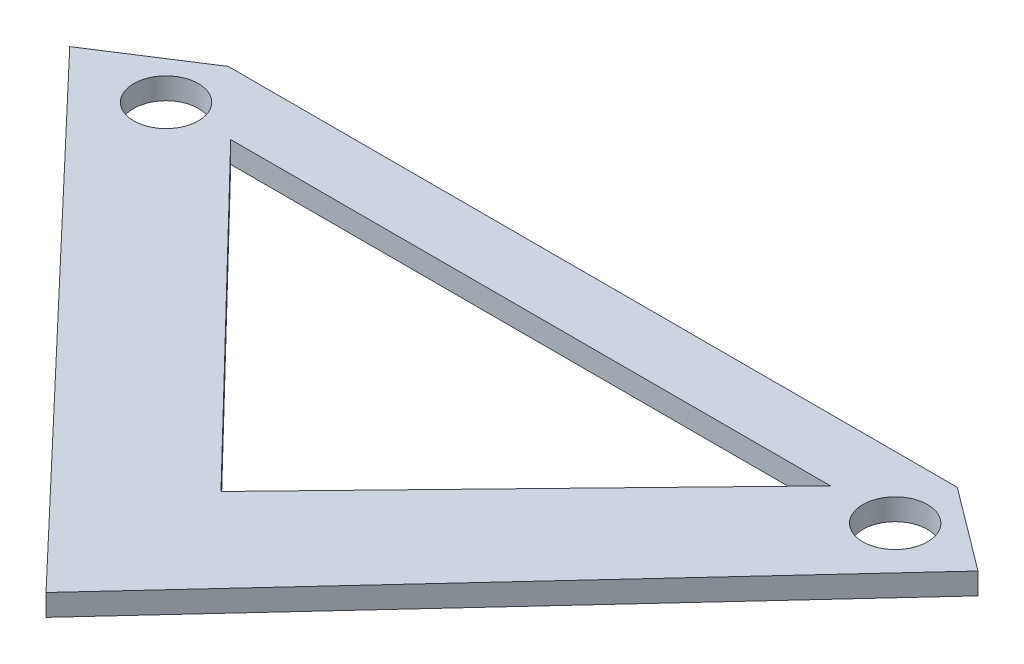
ISO-10303-21;
HEADER;
FILE_DESCRIPTION(('STEP AP214'),'2;1');
FILE_NAME('part.step','',(''),(''),'','','');
FILE_SCHEMA(('AUTOMOTIVE_DESIGN { 1 0 10303 214 1 1 1 1 }'));
ENDSEC;
DATA;
#1=APPLICATION_CONTEXT('core data for automotive mechanical design processes');
#2=APPLICATION_PROTOCOL_DEFINITION('international standard','automotive_design',2000,#1);
#3=PRODUCT_CONTEXT('',#1,'mechanical');
#4=PRODUCT('Part','Part','',(#3));
#5=PRODUCT_RELATED_PRODUCT_CATEGORY('part','',(#4));
#6=PRODUCT_DEFINITION_FORMATION('','',#4);
#7=PRODUCT_DEFINITION_CONTEXT('part definition',#1,'design');
#8=PRODUCT_DEFINITION('design','',#6,#7);
#9=PRODUCT_DEFINITION_SHAPE('','',#8);
#10=(LENGTH_UNIT() NAMED_UNIT(*) SI_UNIT(.MILLI.,.METRE.));
#11=(NAMED_UNIT(*) PLANE_ANGLE_UNIT() SI_UNIT($,.RADIAN.));
#12=(NAMED_UNIT(*) SI_UNIT($,.STERADIAN.) SOLID_ANGLE_UNIT());
#13=UNCERTAINTY_MEASURE_WITH_UNIT(LENGTH_MEASURE(1.E-05),#10,'distance_accuracy_value','');
#14=(GEOMETRIC_REPRESENTATION_CONTEXT(3) GLOBAL_UNCERTAINTY_ASSIGNED_CONTEXT((#13)) GLOBAL_UNIT_ASSIGNED_CONTEXT((#10,
#11,#12)) REPRESENTATION_CONTEXT('',''));
#15=CARTESIAN_POINT('',(0.,0.,0.));
#16=DIRECTION('',(0.,0.,1.));
#17=DIRECTION('',(1.,0.,0.));
#18=AXIS2_PLACEMENT_3D('',#15,#16,#17);
#19=CARTESIAN_POINT('',(0.,1.,0.));
#20=DIRECTION('',(0.,1.,0.));
#21=DIRECTION('',(0.,0.,1.));
#22=AXIS2_PLACEMENT_3D('',#19,#20,#21);
#23=PLANE('',#22);
#24=CARTESIAN_POINT('',(-17.4352691680094,1.,0.));
#25=DIRECTION('',(0.,1.,0.));
#26=DIRECTION('',(0.,0.,1.));
#27=AXIS2_PLACEMENT_3D('',#24,#25,#26);
#28=CIRCLE('',#27,1.5);
#29=CARTESIAN_POINT('',(-17.4352691680094,1.,1.5));
#30=VERTEX_POINT('',#29);
#31=EDGE_CURVE('E124',#30,#30,#28,.T.);
#32=ORIENTED_EDGE('',*,*,#31,.F.);
#33=EDGE_LOOP('',(#32));
#34=FACE_BOUND('',#33,.T.);
#35=DIRECTION('',(-0.840424844409275,0.,0.541928114143976));
#36=VECTOR('',#35,1.);
#37=CARTESIAN_POINT('',(-17.4352691680094,1.,-2.8813544550817));
#38=LINE('',#37,#36);
#39=CARTESIAN_POINT('',(-17.4352691680094,1.,-2.8813544550817));
#40=VERTEX_POINT('',#39);
#41=CARTESIAN_POINT('',(-21.9036881453586,1.,0.));
#42=VERTEX_POINT('',#41);
#43=EDGE_CURVE('E130',#40,#42,#38,.T.);
#44=ORIENTED_EDGE('',*,*,#43,.T.);
#45=DIRECTION('',(0.68912582285352,0.,0.724641704759296));
#46=VECTOR('',#45,1.);
#47=CARTESIAN_POINT('',(-21.9036881453586,1.,0.));
#48=LINE('',#47,#46);
#49=CARTESIAN_POINT('',(-0.520769242957825,1.,22.484942941195));
#50=VERTEX_POINT('',#49);
#51=EDGE_CURVE('E133',#42,#50,#48,.T.);
#52=ORIENTED_EDGE('',*,*,#51,.T.);
#53=DIRECTION('',(0.678302589294266,0.,-0.734782687164508));
#54=VECTOR('',#53,1.);
#55=CARTESIAN_POINT('',(20.2358371436211,1.,0.));
#56=LINE('',#55,#54);
#57=CARTESIAN_POINT('',(20.2358371436211,1.,0.));
#58=VERTEX_POINT('',#57);
#59=EDGE_CURVE('E136',#50,#58,#56,.T.);
#60=ORIENTED_EDGE('',*,*,#59,.T.);
#61=DIRECTION('',(-0.800022526819608,0.,-0.599969963065793));
#62=VECTOR('',#61,1.);
#63=CARTESIAN_POINT('',(16.3937306820937,1.,-2.8813544550817));
#64=LINE('',#63,#62);
#65=CARTESIAN_POINT('',(16.3937306820937,1.,-2.8813544550817));
#66=VERTEX_POINT('',#65);
#67=EDGE_CURVE('E138',#58,#66,#64,.T.);
#68=ORIENTED_EDGE('',*,*,#67,.T.);
#69=DIRECTION('',(-1.,0.,0.));
#70=VECTOR('',#69,1.);
#71=CARTESIAN_POINT('',(-17.4352691680094,1.,-2.8813544550817));
#72=LINE('',#71,#70);
#73=EDGE_CURVE('E140',#66,#40,#72,.T.);
#74=ORIENTED_EDGE('',*,*,#73,.T.);
#75=EDGE_LOOP('',(#44,#52,#60,#68,#74));
#76=FACE_BOUND('',#75,.T.);
#77=DIRECTION('',(0.695724996252577,0.,-0.718308241348623));
#78=VECTOR('',#77,1.);
#79=CARTESIAN_POINT('',(13.3937306820937,1.,0.));
#80=LINE('',#79,#78);
#81=CARTESIAN_POINT('',(-0.520769242957825,1.,14.3661648269725));
#82=VERTEX_POINT('',#81);
#83=CARTESIAN_POINT('',(13.3937306820937,1.,0.));
#84=VERTEX_POINT('',#83);
#85=EDGE_CURVE('E108',#82,#84,#80,.T.);
#86=ORIENTED_EDGE('',*,*,#85,.F.);
#87=DIRECTION('',(0.695724996252577,0.,0.718308241348623));
#88=VECTOR('',#87,1.);
#89=CARTESIAN_POINT('',(-0.520769242957825,1.,14.3661648269725));
#90=LINE('',#89,#88);
#91=CARTESIAN_POINT('',(-14.4352691680094,1.,0.));
#92=VERTEX_POINT('',#91);
#93=EDGE_CURVE('E100',#92,#82,#90,.T.);
#94=ORIENTED_EDGE('',*,*,#93,.F.);
#95=DIRECTION('',(-1.,0.,0.));
#96=VECTOR('',#95,1.);
#97=CARTESIAN_POINT('',(0.,1.,0.));
#98=LINE('',#97,#96);
#99=EDGE_CURVE('E118',#84,#92,#98,.T.);
#100=ORIENTED_EDGE('',*,*,#99,.F.);
#101=EDGE_LOOP('',(#86,#94,#100));
#102=FACE_BOUND('',#101,.T.);
#103=CARTESIAN_POINT('',(16.3937306820937,1.,0.));
#104=DIRECTION('',(0.,1.,0.));
#105=DIRECTION('',(0.,0.,1.));
#106=AXIS2_PLACEMENT_3D('',#103,#104,#105);
#107=CIRCLE('',#106,1.5);
#108=CARTESIAN_POINT('',(16.3937306820937,1.,1.5));
#109=VERTEX_POINT('',#108);
#110=EDGE_CURVE('E294',#109,#109,#107,.T.);
#111=ORIENTED_EDGE('',*,*,#110,.F.);
#112=EDGE_LOOP('',(#111));
#113=FACE_BOUND('',#112,.T.);
#114=ADVANCED_FACE('F35',(#34,#76,#102,#113),#23,.T.);
#115=CARTESIAN_POINT('',(0.,0.,0.));
#116=DIRECTION('',(0.,1.,0.));
#117=DIRECTION('',(0.,0.,1.));
#118=AXIS2_PLACEMENT_3D('',#115,#116,#117);
#119=PLANE('',#118);
#120=CARTESIAN_POINT('',(-17.4352691680094,0.,0.));
#121=DIRECTION('',(0.,1.,0.));
#122=DIRECTION('',(0.,0.,1.));
#123=AXIS2_PLACEMENT_3D('',#120,#121,#122);
#124=CIRCLE('',#123,1.5);
#125=CARTESIAN_POINT('',(-17.4352691680094,0.,1.5));
#126=VERTEX_POINT('',#125);
#127=EDGE_CURVE('E300',#126,#126,#124,.T.);
#128=ORIENTED_EDGE('',*,*,#127,.T.);
#129=EDGE_LOOP('',(#128));
#130=FACE_BOUND('',#129,.T.);
#131=DIRECTION('',(-0.840424844409275,0.,0.541928114143976));
#132=VECTOR('',#131,1.);
#133=CARTESIAN_POINT('',(-17.4352691680094,0.,-2.8813544550817));
#134=LINE('',#133,#132);
#135=CARTESIAN_POINT('',(-17.4352691680094,0.,-2.8813544550817));
#136=VERTEX_POINT('',#135);
#137=CARTESIAN_POINT('',(-21.9036881453586,0.,0.));
#138=VERTEX_POINT('',#137);
#139=EDGE_CURVE('E115',#136,#138,#134,.T.);
#140=ORIENTED_EDGE('',*,*,#139,.F.);
#141=DIRECTION('',(-1.,0.,0.));
#142=VECTOR('',#141,1.);
#143=CARTESIAN_POINT('',(-17.4352691680094,0.,-2.8813544550817));
#144=LINE('',#143,#142);
#145=CARTESIAN_POINT('',(16.3937306820937,0.,-2.8813544550817));
#146=VERTEX_POINT('',#145);
#147=EDGE_CURVE('E134',#146,#136,#144,.T.);
#148=ORIENTED_EDGE('',*,*,#147,.F.);
#149=DIRECTION('',(-0.800022526819608,0.,-0.599969963065793));
#150=VECTOR('',#149,1.);
#151=CARTESIAN_POINT('',(16.3937306820937,0.,-2.8813544550817));
#152=LINE('',#151,#150);
#153=CARTESIAN_POINT('',(20.2358371436211,0.,0.));
#154=VERTEX_POINT('',#153);
#155=EDGE_CURVE('E149',#154,#146,#152,.T.);
#156=ORIENTED_EDGE('',*,*,#155,.F.);
#157=DIRECTION('',(0.678302589294266,0.,-0.734782687164508));
#158=VECTOR('',#157,1.);
#159=CARTESIAN_POINT('',(20.2358371436211,0.,0.));
#160=LINE('',#159,#158);
#161=CARTESIAN_POINT('',(-0.520769242957825,0.,22.484942941195));
#162=VERTEX_POINT('',#161);
#163=EDGE_CURVE('E147',#162,#154,#160,.T.);
#164=ORIENTED_EDGE('',*,*,#163,.F.);
#165=DIRECTION('',(0.68912582285352,0.,0.724641704759296));
#166=VECTOR('',#165,1.);
#167=CARTESIAN_POINT('',(-21.9036881453586,0.,0.));
#168=LINE('',#167,#166);
#169=EDGE_CURVE('E145',#138,#162,#168,.T.);
#170=ORIENTED_EDGE('',*,*,#169,.F.);
#171=EDGE_LOOP('',(#140,#148,#156,#164,#170));
#172=FACE_BOUND('',#171,.T.);
#173=DIRECTION('',(0.695724996252577,0.,0.718308241348623));
#174=VECTOR('',#173,1.);
#175=CARTESIAN_POINT('',(-0.520769242957825,0.,14.3661648269725));
#176=LINE('',#175,#174);
#177=CARTESIAN_POINT('',(-14.4352691680094,0.,0.));
#178=VERTEX_POINT('',#177);
#179=CARTESIAN_POINT('',(-0.520769242957825,0.,14.3661648269725));
#180=VERTEX_POINT('',#179);
#181=EDGE_CURVE('E58',#178,#180,#176,.T.);
#182=ORIENTED_EDGE('',*,*,#181,.T.);
#183=DIRECTION('',(0.695724996252577,0.,-0.718308241348623));
#184=VECTOR('',#183,1.);
#185=CARTESIAN_POINT('',(13.3937306820937,0.,0.));
#186=LINE('',#185,#184);
#187=CARTESIAN_POINT('',(13.3937306820937,0.,0.));
#188=VERTEX_POINT('',#187);
#189=EDGE_CURVE('E114',#180,#188,#186,.T.);
#190=ORIENTED_EDGE('',*,*,#189,.T.);
#191=DIRECTION('',(-1.,0.,0.));
#192=VECTOR('',#191,1.);
#193=CARTESIAN_POINT('',(-14.4352691680094,0.,0.));
#194=LINE('',#193,#192);
#195=EDGE_CURVE('E109',#188,#178,#194,.T.);
#196=ORIENTED_EDGE('',*,*,#195,.T.);
#197=EDGE_LOOP('',(#182,#190,#196));
#198=FACE_BOUND('',#197,.T.);
#199=CARTESIAN_POINT('',(16.3937306820937,0.,0.));
#200=DIRECTION('',(0.,1.,0.));
#201=DIRECTION('',(0.,0.,1.));
#202=AXIS2_PLACEMENT_3D('',#199,#200,#201);
#203=CIRCLE('',#202,1.5);
#204=CARTESIAN_POINT('',(16.3937306820937,0.,1.5));
#205=VERTEX_POINT('',#204);
#206=EDGE_CURVE('E297',#205,#205,#203,.T.);
#207=ORIENTED_EDGE('',*,*,#206,.T.);
#208=EDGE_LOOP('',(#207));
#209=FACE_BOUND('',#208,.T.);
#210=ADVANCED_FACE('F170',(#130,#172,#198,#209),#119,.F.);
#211=CARTESIAN_POINT('',(-17.4352691680094,1.,-2.8813544550817));
#212=DIRECTION('',(0.541928114143976,0.,0.840424844409275));
#213=DIRECTION('',(0.840424844409275,0.,-0.541928114143976));
#214=AXIS2_PLACEMENT_3D('',#211,#212,#213);
#215=PLANE('',#214);
#216=ORIENTED_EDGE('',*,*,#139,.T.);
#217=DIRECTION('',(0.,-1.,0.));
#218=VECTOR('',#217,1.);
#219=CARTESIAN_POINT('',(-21.9036881453586,1.,0.));
#220=LINE('',#219,#218);
#221=EDGE_CURVE('E11',#42,#138,#220,.T.);
#222=ORIENTED_EDGE('',*,*,#221,.F.);
#223=ORIENTED_EDGE('',*,*,#43,.F.);
#224=DIRECTION('',(0.,-1.,0.));
#225=VECTOR('',#224,1.);
#226=CARTESIAN_POINT('',(-17.4352691680094,1.,-2.8813544550817));
#227=LINE('',#226,#225);
#228=EDGE_CURVE('E142',#40,#136,#227,.T.);
#229=ORIENTED_EDGE('',*,*,#228,.T.);
#230=EDGE_LOOP('',(#216,#222,#223,#229));
#231=FACE_BOUND('',#230,.T.);
#232=ADVANCED_FACE('F37',(#231),#215,.F.);
#233=CARTESIAN_POINT('',(-21.9036881453586,1.,0.));
#234=DIRECTION('',(0.724641704759296,0.,-0.68912582285352));
#235=DIRECTION('',(-0.68912582285352,0.,-0.724641704759296));
#236=AXIS2_PLACEMENT_3D('',#233,#234,#235);
#237=PLANE('',#236);
#238=ORIENTED_EDGE('',*,*,#169,.T.);
#239=DIRECTION('',(0.,-1.,0.));
#240=VECTOR('',#239,1.);
#241=CARTESIAN_POINT('',(-0.520769242957825,1.,22.484942941195));
#242=LINE('',#241,#240);
#243=EDGE_CURVE('E43',#50,#162,#242,.T.);
#244=ORIENTED_EDGE('',*,*,#243,.F.);
#245=ORIENTED_EDGE('',*,*,#51,.F.);
#246=ORIENTED_EDGE('',*,*,#221,.T.);
#247=EDGE_LOOP('',(#238,#244,#245,#246));
#248=FACE_BOUND('',#247,.T.);
#249=ADVANCED_FACE('F184',(#248),#237,.F.);
#250=CARTESIAN_POINT('',(20.2358371436211,1.,0.));
#251=DIRECTION('',(-0.734782687164508,0.,-0.678302589294266));
#252=DIRECTION('',(-0.678302589294266,0.,0.734782687164508));
#253=AXIS2_PLACEMENT_3D('',#250,#251,#252);
#254=PLANE('',#253);
#255=ORIENTED_EDGE('',*,*,#163,.T.);
#256=DIRECTION('',(0.,-1.,0.));
#257=VECTOR('',#256,1.);
#258=CARTESIAN_POINT('',(20.2358371436211,1.,0.));
#259=LINE('',#258,#257);
#260=EDGE_CURVE('E157',#58,#154,#259,.T.);
#261=ORIENTED_EDGE('',*,*,#260,.F.);
#262=ORIENTED_EDGE('',*,*,#59,.F.);
#263=ORIENTED_EDGE('',*,*,#243,.T.);
#264=EDGE_LOOP('',(#255,#261,#262,#263));
#265=FACE_BOUND('',#264,.T.);
#266=ADVANCED_FACE('F164',(#265),#254,.F.);
#267=CARTESIAN_POINT('',(16.3937306820937,1.,-2.8813544550817));
#268=DIRECTION('',(-0.599969963065793,0.,0.800022526819608));
#269=DIRECTION('',(0.800022526819609,0.,0.599969963065793));
#270=AXIS2_PLACEMENT_3D('',#267,#268,#269);
#271=PLANE('',#270);
#272=ORIENTED_EDGE('',*,*,#155,.T.);
#273=DIRECTION('',(0.,-1.,0.));
#274=VECTOR('',#273,1.);
#275=CARTESIAN_POINT('',(16.3937306820937,1.,-2.8813544550817));
#276=LINE('',#275,#274);
#277=EDGE_CURVE('E154',#66,#146,#276,.T.);
#278=ORIENTED_EDGE('',*,*,#277,.F.);
#279=ORIENTED_EDGE('',*,*,#67,.F.);
#280=ORIENTED_EDGE('',*,*,#260,.T.);
#281=EDGE_LOOP('',(#272,#278,#279,#280));
#282=FACE_BOUND('',#281,.T.);
#283=ADVANCED_FACE('F175',(#282),#271,.F.);
#284=CARTESIAN_POINT('',(-17.4352691680094,1.,-2.8813544550817));
#285=DIRECTION('',(0.,0.,1.));
#286=DIRECTION('',(1.,0.,0.));
#287=AXIS2_PLACEMENT_3D('',#284,#285,#286);
#288=PLANE('',#287);
#289=ORIENTED_EDGE('',*,*,#147,.T.);
#290=ORIENTED_EDGE('',*,*,#228,.F.);
#291=ORIENTED_EDGE('',*,*,#73,.F.);
#292=ORIENTED_EDGE('',*,*,#277,.T.);
#293=EDGE_LOOP('',(#289,#290,#291,#292));
#294=FACE_BOUND('',#293,.T.);
#295=ADVANCED_FACE('F179',(#294),#288,.F.);
#296=CARTESIAN_POINT('',(-0.520769242957825,1.,14.3661648269725));
#297=DIRECTION('',(0.718308241348623,0.,-0.695724996252577));
#298=DIRECTION('',(-0.695724996252577,0.,-0.718308241348623));
#299=AXIS2_PLACEMENT_3D('',#296,#297,#298);
#300=PLANE('',#299);
#301=ORIENTED_EDGE('',*,*,#181,.F.);
#302=DIRECTION('',(0.,-1.,0.));
#303=VECTOR('',#302,1.);
#304=CARTESIAN_POINT('',(-14.4352691680094,1.,0.));
#305=LINE('',#304,#303);
#306=EDGE_CURVE('E104',#92,#178,#305,.T.);
#307=ORIENTED_EDGE('',*,*,#306,.F.);
#308=ORIENTED_EDGE('',*,*,#93,.T.);
#309=DIRECTION('',(0.,-1.,0.));
#310=VECTOR('',#309,1.);
#311=CARTESIAN_POINT('',(-0.520769242957825,1.,14.3661648269725));
#312=LINE('',#311,#310);
#313=EDGE_CURVE('E103',#82,#180,#312,.T.);
#314=ORIENTED_EDGE('',*,*,#313,.T.);
#315=EDGE_LOOP('',(#301,#307,#308,#314));
#316=FACE_BOUND('',#315,.T.);
#317=ADVANCED_FACE('F102',(#316),#300,.T.);
#318=CARTESIAN_POINT('',(13.3937306820937,1.,0.));
#319=DIRECTION('',(-0.718308241348623,0.,-0.695724996252577));
#320=DIRECTION('',(-0.695724996252577,0.,0.718308241348623));
#321=AXIS2_PLACEMENT_3D('',#318,#319,#320);
#322=PLANE('',#321);
#323=ORIENTED_EDGE('',*,*,#189,.F.);
#324=ORIENTED_EDGE('',*,*,#313,.F.);
#325=ORIENTED_EDGE('',*,*,#85,.T.);
#326=DIRECTION('',(0.,-1.,0.));
#327=VECTOR('',#326,1.);
#328=CARTESIAN_POINT('',(13.3937306820937,1.,0.));
#329=LINE('',#328,#327);
#330=EDGE_CURVE('E50',#84,#188,#329,.T.);
#331=ORIENTED_EDGE('',*,*,#330,.T.);
#332=EDGE_LOOP('',(#323,#324,#325,#331));
#333=FACE_BOUND('',#332,.T.);
#334=ADVANCED_FACE('F112',(#333),#322,.T.);
#335=CARTESIAN_POINT('',(-14.4352691680094,1.,0.));
#336=DIRECTION('',(0.,0.,1.));
#337=DIRECTION('',(1.,0.,0.));
#338=AXIS2_PLACEMENT_3D('',#335,#336,#337);
#339=PLANE('',#338);
#340=ORIENTED_EDGE('',*,*,#195,.F.);
#341=ORIENTED_EDGE('',*,*,#330,.F.);
#342=ORIENTED_EDGE('',*,*,#99,.T.);
#343=ORIENTED_EDGE('',*,*,#306,.T.);
#344=EDGE_LOOP('',(#340,#341,#342,#343));
#345=FACE_BOUND('',#344,.T.);
#346=ADVANCED_FACE('F230',(#345),#339,.T.);
#347=CARTESIAN_POINT('',(-17.4352691680094,1.,0.));
#348=DIRECTION('',(0.,-1.,0.));
#349=DIRECTION('',(0.,0.,-1.));
#350=AXIS2_PLACEMENT_3D('',#347,#348,#349);
#351=CYLINDRICAL_SURFACE('',#350,1.5);
#352=ORIENTED_EDGE('',*,*,#31,.T.);
#353=EDGE_LOOP('',(#352));
#354=FACE_BOUND('',#353,.T.);
#355=ORIENTED_EDGE('',*,*,#127,.F.);
#356=EDGE_LOOP('',(#355));
#357=FACE_BOUND('',#356,.T.);
#358=ADVANCED_FACE('F236',(#354,#357),#351,.F.);
#359=CARTESIAN_POINT('',(16.3937306820937,1.,0.));
#360=DIRECTION('',(0.,-1.,0.));
#361=DIRECTION('',(0.,0.,-1.));
#362=AXIS2_PLACEMENT_3D('',#359,#360,#361);
#363=CYLINDRICAL_SURFACE('',#362,1.5);
#364=ORIENTED_EDGE('',*,*,#110,.T.);
#365=EDGE_LOOP('',(#364));
#366=FACE_BOUND('',#365,.T.);
#367=ORIENTED_EDGE('',*,*,#206,.F.);
#368=EDGE_LOOP('',(#367));
#369=FACE_BOUND('',#368,.T.);
#370=ADVANCED_FACE('F243',(#366,#369),#363,.F.);
#371=CLOSED_SHELL('',(#114,#210,#232,#249,#266,#283,#295,#317,#334,#346,#358,#370));
#372=MANIFOLD_SOLID_BREP('B2',#371);
#373=ADVANCED_BREP_SHAPE_REPRESENTATION('',(#18,#372),#14);
#374=SHAPE_DEFINITION_REPRESENTATION(#9,#373);
ENDSEC;
END-ISO-10303-21;
